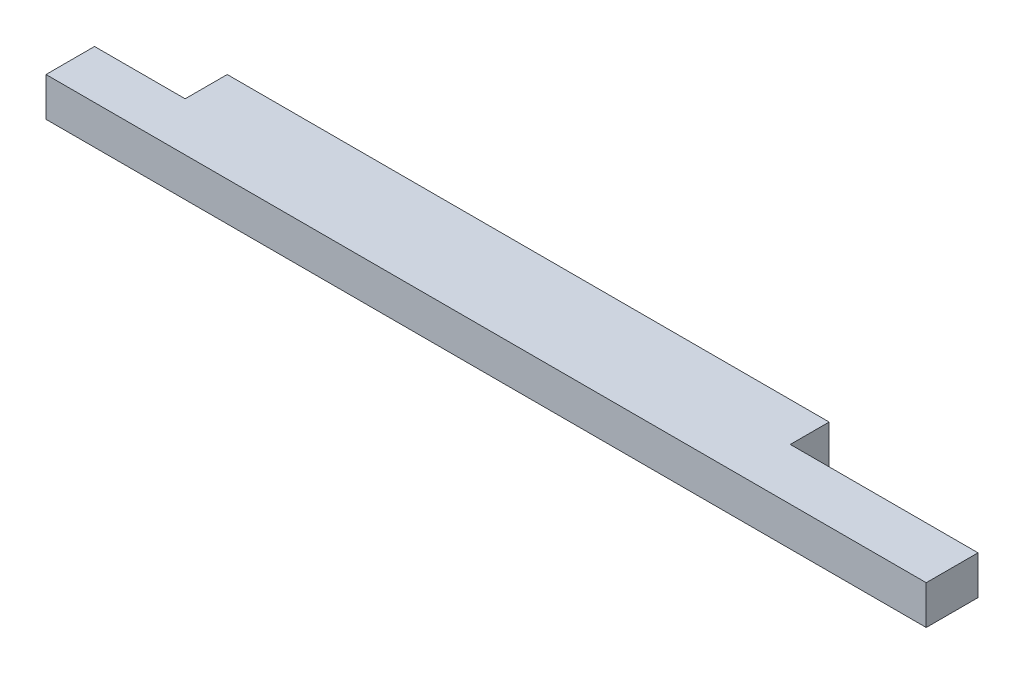
ISO-10303-21;
HEADER;
FILE_DESCRIPTION(('STEP AP214'),'2;1');
FILE_NAME('part.step','',(''),(''),'','','');
FILE_SCHEMA(('AUTOMOTIVE_DESIGN { 1 0 10303 214 1 1 1 1 }'));
ENDSEC;
DATA;
#1=APPLICATION_CONTEXT('core data for automotive mechanical design processes');
#2=APPLICATION_PROTOCOL_DEFINITION('international standard','automotive_design',2000,#1);
#3=PRODUCT_CONTEXT('',#1,'mechanical');
#4=PRODUCT('Part','Part','',(#3));
#5=PRODUCT_RELATED_PRODUCT_CATEGORY('part','',(#4));
#6=PRODUCT_DEFINITION_FORMATION('','',#4);
#7=PRODUCT_DEFINITION_CONTEXT('part definition',#1,'design');
#8=PRODUCT_DEFINITION('design','',#6,#7);
#9=PRODUCT_DEFINITION_SHAPE('','',#8);
#10=(LENGTH_UNIT() NAMED_UNIT(*) SI_UNIT(.MILLI.,.METRE.));
#11=(NAMED_UNIT(*) PLANE_ANGLE_UNIT() SI_UNIT($,.RADIAN.));
#12=(NAMED_UNIT(*) SI_UNIT($,.STERADIAN.) SOLID_ANGLE_UNIT());
#13=UNCERTAINTY_MEASURE_WITH_UNIT(LENGTH_MEASURE(1.E-05),#10,'distance_accuracy_value','');
#14=(GEOMETRIC_REPRESENTATION_CONTEXT(3) GLOBAL_UNCERTAINTY_ASSIGNED_CONTEXT((#13)) GLOBAL_UNIT_ASSIGNED_CONTEXT((#10,
#11,#12)) REPRESENTATION_CONTEXT('',''));
#15=CARTESIAN_POINT('',(0.,0.,0.));
#16=DIRECTION('',(0.,0.,1.));
#17=DIRECTION('',(1.,0.,0.));
#18=AXIS2_PLACEMENT_3D('',#15,#16,#17);
#19=CARTESIAN_POINT('',(0.,38.1,0.));
#20=DIRECTION('',(1.,0.,0.));
#21=DIRECTION('',(0.,0.,-1.));
#22=AXIS2_PLACEMENT_3D('',#19,#20,#21);
#23=PLANE('',#22);
#24=DIRECTION('',(0.,0.,1.));
#25=VECTOR('',#24,1.);
#26=CARTESIAN_POINT('',(0.,38.1,0.));
#27=LINE('',#26,#25);
#28=CARTESIAN_POINT('',(0.,38.1,-47.625));
#29=VERTEX_POINT('',#28);
#30=CARTESIAN_POINT('',(0.,38.1,0.));
#31=VERTEX_POINT('',#30);
#32=EDGE_CURVE('E118',#29,#31,#27,.T.);
#33=ORIENTED_EDGE('',*,*,#32,.F.);
#34=DIRECTION('',(0.,1.,0.));
#35=VECTOR('',#34,1.);
#36=CARTESIAN_POINT('',(0.,0.,-47.625));
#37=LINE('',#36,#35);
#38=CARTESIAN_POINT('',(0.,0.,-47.625));
#39=VERTEX_POINT('',#38);
#40=EDGE_CURVE('E106',#39,#29,#37,.T.);
#41=ORIENTED_EDGE('',*,*,#40,.F.);
#42=DIRECTION('',(0.,0.,1.));
#43=VECTOR('',#42,1.);
#44=CARTESIAN_POINT('',(0.,0.,0.));
#45=LINE('',#44,#43);
#46=CARTESIAN_POINT('',(0.,0.,0.));
#47=VERTEX_POINT('',#46);
#48=EDGE_CURVE('E116',#39,#47,#45,.T.);
#49=ORIENTED_EDGE('',*,*,#48,.T.);
#50=DIRECTION('',(0.,-1.,0.));
#51=VECTOR('',#50,1.);
#52=CARTESIAN_POINT('',(0.,38.1,0.));
#53=LINE('',#52,#51);
#54=EDGE_CURVE('E11',#31,#47,#53,.T.);
#55=ORIENTED_EDGE('',*,*,#54,.F.);
#56=EDGE_LOOP('',(#33,#41,#49,#55));
#57=FACE_BOUND('',#56,.T.);
#58=ADVANCED_FACE('F39',(#57),#23,.F.);
#59=CARTESIAN_POINT('',(0.,38.1,0.));
#60=DIRECTION('',(0.,0.,-1.));
#61=DIRECTION('',(-1.,0.,0.));
#62=AXIS2_PLACEMENT_3D('',#59,#60,#61);
#63=PLANE('',#62);
#64=DIRECTION('',(1.,0.,0.));
#65=VECTOR('',#64,1.);
#66=CARTESIAN_POINT('',(0.,0.,0.));
#67=LINE('',#66,#65);
#68=CARTESIAN_POINT('',(863.6,0.,0.));
#69=VERTEX_POINT('',#68);
#70=EDGE_CURVE('E122',#47,#69,#67,.T.);
#71=ORIENTED_EDGE('',*,*,#70,.T.);
#72=DIRECTION('',(0.,-1.,0.));
#73=VECTOR('',#72,1.);
#74=CARTESIAN_POINT('',(863.6,38.1,0.));
#75=LINE('',#74,#73);
#76=CARTESIAN_POINT('',(863.6,38.1,0.));
#77=VERTEX_POINT('',#76);
#78=EDGE_CURVE('E46',#77,#69,#75,.T.);
#79=ORIENTED_EDGE('',*,*,#78,.F.);
#80=DIRECTION('',(1.,0.,0.));
#81=VECTOR('',#80,1.);
#82=CARTESIAN_POINT('',(0.,38.1,0.));
#83=LINE('',#82,#81);
#84=EDGE_CURVE('E149',#31,#77,#83,.T.);
#85=ORIENTED_EDGE('',*,*,#84,.F.);
#86=ORIENTED_EDGE('',*,*,#54,.T.);
#87=EDGE_LOOP('',(#71,#79,#85,#86));
#88=FACE_BOUND('',#87,.T.);
#89=ADVANCED_FACE('F183',(#88),#63,.F.);
#90=CARTESIAN_POINT('',(863.6,38.1,0.));
#91=DIRECTION('',(-1.,0.,0.));
#92=DIRECTION('',(0.,0.,1.));
#93=AXIS2_PLACEMENT_3D('',#90,#91,#92);
#94=PLANE('',#93);
#95=DIRECTION('',(0.,0.,-1.));
#96=VECTOR('',#95,1.);
#97=CARTESIAN_POINT('',(863.6,0.,0.));
#98=LINE('',#97,#96);
#99=CARTESIAN_POINT('',(863.6,0.,-50.8));
#100=VERTEX_POINT('',#99);
#101=EDGE_CURVE('E125',#69,#100,#98,.T.);
#102=ORIENTED_EDGE('',*,*,#101,.T.);
#103=DIRECTION('',(0.,1.,0.));
#104=VECTOR('',#103,1.);
#105=CARTESIAN_POINT('',(863.6,0.,-50.8));
#106=LINE('',#105,#104);
#107=CARTESIAN_POINT('',(863.6,38.1,-50.8));
#108=VERTEX_POINT('',#107);
#109=EDGE_CURVE('E123',#100,#108,#106,.T.);
#110=ORIENTED_EDGE('',*,*,#109,.T.);
#111=DIRECTION('',(0.,0.,-1.));
#112=VECTOR('',#111,1.);
#113=CARTESIAN_POINT('',(863.6,38.1,0.));
#114=LINE('',#113,#112);
#115=EDGE_CURVE('E143',#77,#108,#114,.T.);
#116=ORIENTED_EDGE('',*,*,#115,.F.);
#117=ORIENTED_EDGE('',*,*,#78,.T.);
#118=EDGE_LOOP('',(#102,#110,#116,#117));
#119=FACE_BOUND('',#118,.T.);
#120=ADVANCED_FACE('F181',(#119),#94,.F.);
#121=CARTESIAN_POINT('',(0.,38.1,-88.9));
#122=DIRECTION('',(0.,0.,1.));
#123=DIRECTION('',(1.,0.,0.));
#124=AXIS2_PLACEMENT_3D('',#121,#122,#123);
#125=PLANE('',#124);
#126=DIRECTION('',(-1.,0.,0.));
#127=VECTOR('',#126,1.);
#128=CARTESIAN_POINT('',(0.,0.,-88.9));
#129=LINE('',#128,#127);
#130=CARTESIAN_POINT('',(679.45,0.,-88.8999999999999));
#131=VERTEX_POINT('',#130);
#132=CARTESIAN_POINT('',(88.9,0.,-88.9));
#133=VERTEX_POINT('',#132);
#134=EDGE_CURVE('E136',#131,#133,#129,.T.);
#135=ORIENTED_EDGE('',*,*,#134,.T.);
#136=DIRECTION('',(0.,1.,0.));
#137=VECTOR('',#136,1.);
#138=CARTESIAN_POINT('',(88.9,0.,-88.9));
#139=LINE('',#138,#137);
#140=CARTESIAN_POINT('',(88.9,38.1,-88.9));
#141=VERTEX_POINT('',#140);
#142=EDGE_CURVE('E163',#133,#141,#139,.T.);
#143=ORIENTED_EDGE('',*,*,#142,.T.);
#144=DIRECTION('',(-1.,0.,0.));
#145=VECTOR('',#144,1.);
#146=CARTESIAN_POINT('',(0.,38.1,-88.9));
#147=LINE('',#146,#145);
#148=CARTESIAN_POINT('',(679.45,38.1,-88.8999999999999));
#149=VERTEX_POINT('',#148);
#150=EDGE_CURVE('E131',#149,#141,#147,.T.);
#151=ORIENTED_EDGE('',*,*,#150,.F.);
#152=DIRECTION('',(0.,1.,0.));
#153=VECTOR('',#152,1.);
#154=CARTESIAN_POINT('',(679.45,0.,-88.8999999999999));
#155=LINE('',#154,#153);
#156=EDGE_CURVE('E154',#131,#149,#155,.T.);
#157=ORIENTED_EDGE('',*,*,#156,.F.);
#158=EDGE_LOOP('',(#135,#143,#151,#157));
#159=FACE_BOUND('',#158,.T.);
#160=ADVANCED_FACE('F176',(#159),#125,.F.);
#161=CARTESIAN_POINT('',(0.,38.1,0.));
#162=DIRECTION('',(0.,-1.,0.));
#163=DIRECTION('',(0.,0.,-1.));
#164=AXIS2_PLACEMENT_3D('',#161,#162,#163);
#165=PLANE('',#164);
#166=ORIENTED_EDGE('',*,*,#150,.T.);
#167=DIRECTION('',(0.,0.,-1.));
#168=VECTOR('',#167,1.);
#169=CARTESIAN_POINT('',(88.9,38.1,-88.9));
#170=LINE('',#169,#168);
#171=CARTESIAN_POINT('',(88.9,38.1,-47.625));
#172=VERTEX_POINT('',#171);
#173=EDGE_CURVE('E111',#172,#141,#170,.T.);
#174=ORIENTED_EDGE('',*,*,#173,.F.);
#175=DIRECTION('',(1.,0.,0.));
#176=VECTOR('',#175,1.);
#177=CARTESIAN_POINT('',(0.,38.1,-47.625));
#178=LINE('',#177,#176);
#179=EDGE_CURVE('E171',#29,#172,#178,.T.);
#180=ORIENTED_EDGE('',*,*,#179,.F.);
#181=ORIENTED_EDGE('',*,*,#32,.T.);
#182=ORIENTED_EDGE('',*,*,#84,.T.);
#183=ORIENTED_EDGE('',*,*,#115,.T.);
#184=DIRECTION('',(1.,0.,0.));
#185=VECTOR('',#184,1.);
#186=CARTESIAN_POINT('',(863.6,38.1,-50.8));
#187=LINE('',#186,#185);
#188=CARTESIAN_POINT('',(679.45,38.1,-50.8));
#189=VERTEX_POINT('',#188);
#190=EDGE_CURVE('E157',#189,#108,#187,.T.);
#191=ORIENTED_EDGE('',*,*,#190,.F.);
#192=DIRECTION('',(0.,0.,1.));
#193=VECTOR('',#192,1.);
#194=CARTESIAN_POINT('',(679.45,38.1,-88.8999999999999));
#195=LINE('',#194,#193);
#196=EDGE_CURVE('E160',#149,#189,#195,.T.);
#197=ORIENTED_EDGE('',*,*,#196,.F.);
#198=EDGE_LOOP('',(#166,#174,#180,#181,#182,#183,#191,#197));
#199=FACE_BOUND('',#198,.T.);
#200=ADVANCED_FACE('F179',(#199),#165,.F.);
#201=CARTESIAN_POINT('',(0.,0.,0.));
#202=DIRECTION('',(0.,-1.,0.));
#203=DIRECTION('',(0.,0.,-1.));
#204=AXIS2_PLACEMENT_3D('',#201,#202,#203);
#205=PLANE('',#204);
#206=DIRECTION('',(0.,0.,-1.));
#207=VECTOR('',#206,1.);
#208=CARTESIAN_POINT('',(88.9,0.,-88.9));
#209=LINE('',#208,#207);
#210=CARTESIAN_POINT('',(88.9,0.,-47.625));
#211=VERTEX_POINT('',#210);
#212=EDGE_CURVE('E53',#211,#133,#209,.T.);
#213=ORIENTED_EDGE('',*,*,#212,.T.);
#214=ORIENTED_EDGE('',*,*,#134,.F.);
#215=DIRECTION('',(0.,0.,1.));
#216=VECTOR('',#215,1.);
#217=CARTESIAN_POINT('',(679.45,0.,-88.8999999999999));
#218=LINE('',#217,#216);
#219=CARTESIAN_POINT('',(679.45,0.,-50.8));
#220=VERTEX_POINT('',#219);
#221=EDGE_CURVE('E159',#131,#220,#218,.T.);
#222=ORIENTED_EDGE('',*,*,#221,.T.);
#223=DIRECTION('',(1.,0.,0.));
#224=VECTOR('',#223,1.);
#225=CARTESIAN_POINT('',(863.6,0.,-50.8));
#226=LINE('',#225,#224);
#227=EDGE_CURVE('E61',#220,#100,#226,.T.);
#228=ORIENTED_EDGE('',*,*,#227,.T.);
#229=ORIENTED_EDGE('',*,*,#101,.F.);
#230=ORIENTED_EDGE('',*,*,#70,.F.);
#231=ORIENTED_EDGE('',*,*,#48,.F.);
#232=DIRECTION('',(1.,0.,0.));
#233=VECTOR('',#232,1.);
#234=CARTESIAN_POINT('',(0.,0.,-47.625));
#235=LINE('',#234,#233);
#236=EDGE_CURVE('E102',#39,#211,#235,.T.);
#237=ORIENTED_EDGE('',*,*,#236,.T.);
#238=EDGE_LOOP('',(#213,#214,#222,#228,#229,#230,#231,#237));
#239=FACE_BOUND('',#238,.T.);
#240=ADVANCED_FACE('F120',(#239),#205,.T.);
#241=CARTESIAN_POINT('',(863.6,0.,-50.8));
#242=DIRECTION('',(0.,0.,1.));
#243=DIRECTION('',(1.,0.,0.));
#244=AXIS2_PLACEMENT_3D('',#241,#242,#243);
#245=PLANE('',#244);
#246=ORIENTED_EDGE('',*,*,#190,.T.);
#247=ORIENTED_EDGE('',*,*,#109,.F.);
#248=ORIENTED_EDGE('',*,*,#227,.F.);
#249=DIRECTION('',(0.,1.,0.));
#250=VECTOR('',#249,1.);
#251=CARTESIAN_POINT('',(679.45,0.,-50.8));
#252=LINE('',#251,#250);
#253=EDGE_CURVE('E128',#220,#189,#252,.T.);
#254=ORIENTED_EDGE('',*,*,#253,.T.);
#255=EDGE_LOOP('',(#246,#247,#248,#254));
#256=FACE_BOUND('',#255,.T.);
#257=ADVANCED_FACE('F180',(#256),#245,.F.);
#258=CARTESIAN_POINT('',(679.45,0.,-88.8999999999999));
#259=DIRECTION('',(-1.,0.,0.));
#260=DIRECTION('',(0.,0.,1.));
#261=AXIS2_PLACEMENT_3D('',#258,#259,#260);
#262=PLANE('',#261);
#263=ORIENTED_EDGE('',*,*,#196,.T.);
#264=ORIENTED_EDGE('',*,*,#253,.F.);
#265=ORIENTED_EDGE('',*,*,#221,.F.);
#266=ORIENTED_EDGE('',*,*,#156,.T.);
#267=EDGE_LOOP('',(#263,#264,#265,#266));
#268=FACE_BOUND('',#267,.T.);
#269=ADVANCED_FACE('F178',(#268),#262,.F.);
#270=CARTESIAN_POINT('',(88.9,0.,-88.9));
#271=DIRECTION('',(1.,0.,0.));
#272=DIRECTION('',(0.,0.,-1.));
#273=AXIS2_PLACEMENT_3D('',#270,#271,#272);
#274=PLANE('',#273);
#275=ORIENTED_EDGE('',*,*,#173,.T.);
#276=ORIENTED_EDGE('',*,*,#142,.F.);
#277=ORIENTED_EDGE('',*,*,#212,.F.);
#278=DIRECTION('',(0.,1.,0.));
#279=VECTOR('',#278,1.);
#280=CARTESIAN_POINT('',(88.9,0.,-47.625));
#281=LINE('',#280,#279);
#282=EDGE_CURVE('E108',#211,#172,#281,.T.);
#283=ORIENTED_EDGE('',*,*,#282,.T.);
#284=EDGE_LOOP('',(#275,#276,#277,#283));
#285=FACE_BOUND('',#284,.T.);
#286=ADVANCED_FACE('F223',(#285),#274,.F.);
#287=CARTESIAN_POINT('',(0.,0.,-47.625));
#288=DIRECTION('',(0.,0.,1.));
#289=DIRECTION('',(1.,0.,0.));
#290=AXIS2_PLACEMENT_3D('',#287,#288,#289);
#291=PLANE('',#290);
#292=ORIENTED_EDGE('',*,*,#179,.T.);
#293=ORIENTED_EDGE('',*,*,#282,.F.);
#294=ORIENTED_EDGE('',*,*,#236,.F.);
#295=ORIENTED_EDGE('',*,*,#40,.T.);
#296=EDGE_LOOP('',(#292,#293,#294,#295));
#297=FACE_BOUND('',#296,.T.);
#298=ADVANCED_FACE('F105',(#297),#291,.F.);
#299=CLOSED_SHELL('',(#58,#89,#120,#160,#200,#240,#257,#269,#286,#298));
#300=MANIFOLD_SOLID_BREP('B2',#299);
#301=ADVANCED_BREP_SHAPE_REPRESENTATION('',(#18,#300),#14);
#302=SHAPE_DEFINITION_REPRESENTATION(#9,#301);
ENDSEC;
END-ISO-10303-21;
